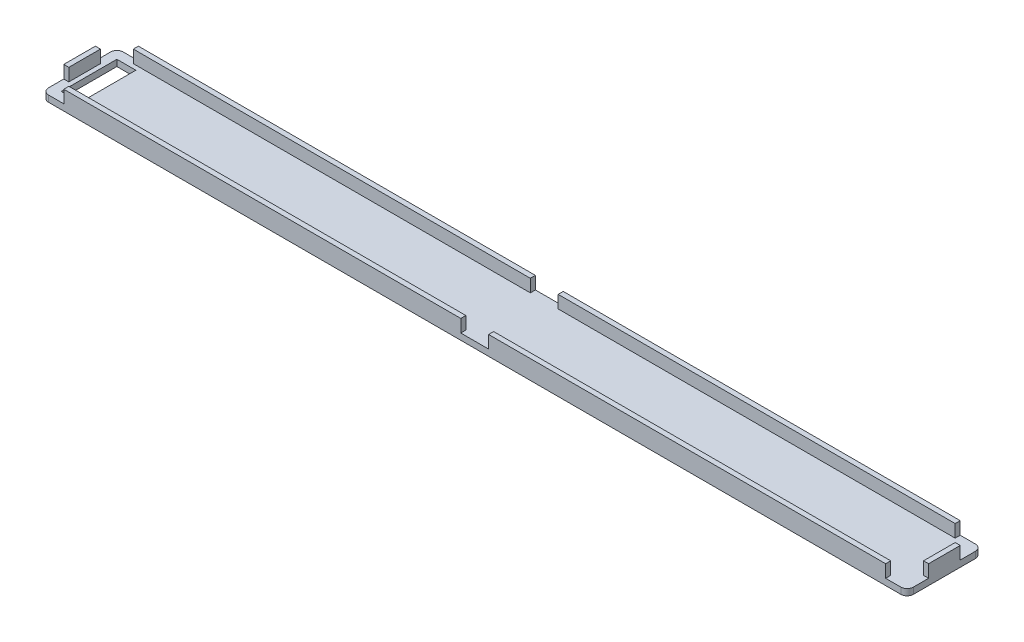
ISO-10303-21;
HEADER;
FILE_DESCRIPTION(('STEP AP214'),'2;1');
FILE_NAME('part.step','',(''),(''),'','','');
FILE_SCHEMA(('AUTOMOTIVE_DESIGN { 1 0 10303 214 1 1 1 1 }'));
ENDSEC;
DATA;
#1=APPLICATION_CONTEXT('core data for automotive mechanical design processes');
#2=APPLICATION_PROTOCOL_DEFINITION('international standard','automotive_design',2000,#1);
#3=PRODUCT_CONTEXT('',#1,'mechanical');
#4=PRODUCT('Part','Part','',(#3));
#5=PRODUCT_RELATED_PRODUCT_CATEGORY('part','',(#4));
#6=PRODUCT_DEFINITION_FORMATION('','',#4);
#7=PRODUCT_DEFINITION_CONTEXT('part definition',#1,'design');
#8=PRODUCT_DEFINITION('design','',#6,#7);
#9=PRODUCT_DEFINITION_SHAPE('','',#8);
#10=(LENGTH_UNIT() NAMED_UNIT(*) SI_UNIT(.MILLI.,.METRE.));
#11=(NAMED_UNIT(*) PLANE_ANGLE_UNIT() SI_UNIT($,.RADIAN.));
#12=(NAMED_UNIT(*) SI_UNIT($,.STERADIAN.) SOLID_ANGLE_UNIT());
#13=UNCERTAINTY_MEASURE_WITH_UNIT(LENGTH_MEASURE(1.E-05),#10,'distance_accuracy_value','');
#14=(GEOMETRIC_REPRESENTATION_CONTEXT(3) GLOBAL_UNCERTAINTY_ASSIGNED_CONTEXT((#13)) GLOBAL_UNIT_ASSIGNED_CONTEXT((#10,
#11,#12)) REPRESENTATION_CONTEXT('',''));
#15=CARTESIAN_POINT('',(0.,0.,0.));
#16=DIRECTION('',(0.,0.,1.));
#17=DIRECTION('',(1.,0.,0.));
#18=AXIS2_PLACEMENT_3D('',#15,#16,#17);
#19=CARTESIAN_POINT('',(0.,3.,0.));
#20=DIRECTION('',(0.,-1.,0.));
#21=DIRECTION('',(0.,0.,-1.));
#22=AXIS2_PLACEMENT_3D('',#19,#20,#21);
#23=PLANE('',#22);
#24=DIRECTION('',(1.,0.,0.));
#25=VECTOR('',#24,1.);
#26=CARTESIAN_POINT('',(136.8,3.,0.));
#27=LINE('',#26,#25);
#28=CARTESIAN_POINT('',(70.6,3.,0.));
#29=VERTEX_POINT('',#28);
#30=CARTESIAN_POINT('',(133.4,3.,0.));
#31=VERTEX_POINT('',#30);
#32=EDGE_CURVE('E485',#29,#31,#27,.T.);
#33=ORIENTED_EDGE('',*,*,#32,.T.);
#34=DIRECTION('',(0.,0.,1.));
#35=VECTOR('',#34,1.);
#36=CARTESIAN_POINT('',(133.4,3.,-0.799999999999993));
#37=LINE('',#36,#35);
#38=CARTESIAN_POINT('',(133.4,3.,-0.799999999999993));
#39=VERTEX_POINT('',#38);
#40=EDGE_CURVE('E307',#39,#31,#37,.T.);
#41=ORIENTED_EDGE('',*,*,#40,.F.);
#42=DIRECTION('',(1.,0.,0.));
#43=VECTOR('',#42,1.);
#44=CARTESIAN_POINT('',(136.,3.,-0.8));
#45=LINE('',#44,#43);
#46=CARTESIAN_POINT('',(70.6,3.,-0.799999999999985));
#47=VERTEX_POINT('',#46);
#48=EDGE_CURVE('E456',#47,#39,#45,.T.);
#49=ORIENTED_EDGE('',*,*,#48,.F.);
#50=DIRECTION('',(0.,0.,-1.));
#51=VECTOR('',#50,1.);
#52=CARTESIAN_POINT('',(70.6,3.,0.));
#53=LINE('',#52,#51);
#54=EDGE_CURVE('E390',#29,#47,#53,.T.);
#55=ORIENTED_EDGE('',*,*,#54,.F.);
#56=EDGE_LOOP('',(#33,#41,#49,#55));
#57=FACE_BOUND('',#56,.T.);
#58=ADVANCED_FACE('F39',(#57),#23,.F.);
#59=CARTESIAN_POINT('',(3.39999999999999,3.,0.));
#60=VERTEX_POINT('',#59);
#61=CARTESIAN_POINT('',(66.2,3.,0.));
#62=VERTEX_POINT('',#61);
#63=EDGE_CURVE('E488',#60,#62,#27,.T.);
#64=ORIENTED_EDGE('',*,*,#63,.T.);
#65=DIRECTION('',(0.,0.,1.));
#66=VECTOR('',#65,1.);
#67=CARTESIAN_POINT('',(66.2,3.,0.));
#68=LINE('',#67,#66);
#69=CARTESIAN_POINT('',(66.2,3.,-0.799999999999983));
#70=VERTEX_POINT('',#69);
#71=EDGE_CURVE('E384',#70,#62,#68,.T.);
#72=ORIENTED_EDGE('',*,*,#71,.F.);
#73=CARTESIAN_POINT('',(3.39999999999999,3.,-0.799999999999977));
#74=VERTEX_POINT('',#73);
#75=EDGE_CURVE('E459',#74,#70,#45,.T.);
#76=ORIENTED_EDGE('',*,*,#75,.F.);
#77=DIRECTION('',(0.,0.,-1.));
#78=VECTOR('',#77,1.);
#79=CARTESIAN_POINT('',(3.39999999999999,3.,-0.799999999999977));
#80=LINE('',#79,#78);
#81=EDGE_CURVE('E368',#60,#74,#80,.T.);
#82=ORIENTED_EDGE('',*,*,#81,.F.);
#83=EDGE_LOOP('',(#64,#72,#76,#82));
#84=FACE_BOUND('',#83,.T.);
#85=ADVANCED_FACE('F586',(#84),#23,.F.);
#86=DIRECTION('',(0.,0.,1.));
#87=VECTOR('',#86,1.);
#88=CARTESIAN_POINT('',(0.,3.,-11.8));
#89=LINE('',#88,#87);
#90=CARTESIAN_POINT('',(0.,3.,-8.39999999999998));
#91=VERTEX_POINT('',#90);
#92=CARTESIAN_POINT('',(0.,3.,-3.39999999999998));
#93=VERTEX_POINT('',#92);
#94=EDGE_CURVE('E482',#91,#93,#89,.T.);
#95=ORIENTED_EDGE('',*,*,#94,.T.);
#96=DIRECTION('',(-1.,0.,0.));
#97=VECTOR('',#96,1.);
#98=CARTESIAN_POINT('',(0.,3.,-3.39999999999998));
#99=LINE('',#98,#97);
#100=CARTESIAN_POINT('',(0.799999999999996,3.,-3.39999999999998));
#101=VERTEX_POINT('',#100);
#102=EDGE_CURVE('E360',#101,#93,#99,.T.);
#103=ORIENTED_EDGE('',*,*,#102,.F.);
#104=DIRECTION('',(0.,0.,1.));
#105=VECTOR('',#104,1.);
#106=CARTESIAN_POINT('',(0.799999999999995,3.,-11.));
#107=LINE('',#106,#105);
#108=CARTESIAN_POINT('',(0.799999999999995,3.,-8.39999999999998));
#109=VERTEX_POINT('',#108);
#110=EDGE_CURVE('E453',#109,#101,#107,.T.);
#111=ORIENTED_EDGE('',*,*,#110,.F.);
#112=DIRECTION('',(1.,0.,0.));
#113=VECTOR('',#112,1.);
#114=CARTESIAN_POINT('',(0.,3.,-8.39999999999998));
#115=LINE('',#114,#113);
#116=EDGE_CURVE('E338',#91,#109,#115,.T.);
#117=ORIENTED_EDGE('',*,*,#116,.F.);
#118=EDGE_LOOP('',(#95,#103,#111,#117));
#119=FACE_BOUND('',#118,.T.);
#120=ADVANCED_FACE('F570',(#119),#23,.F.);
#121=DIRECTION('',(-1.,0.,0.));
#122=VECTOR('',#121,1.);
#123=CARTESIAN_POINT('',(136.8,3.,-11.8));
#124=LINE('',#123,#122);
#125=CARTESIAN_POINT('',(66.2,3.,-11.8));
#126=VERTEX_POINT('',#125);
#127=CARTESIAN_POINT('',(3.39999999999999,3.,-11.8));
#128=VERTEX_POINT('',#127);
#129=EDGE_CURVE('E478',#126,#128,#124,.T.);
#130=ORIENTED_EDGE('',*,*,#129,.T.);
#131=DIRECTION('',(0.,0.,-1.));
#132=VECTOR('',#131,1.);
#133=CARTESIAN_POINT('',(3.39999999999999,3.,-11.));
#134=LINE('',#133,#132);
#135=CARTESIAN_POINT('',(3.39999999999999,3.,-11.));
#136=VERTEX_POINT('',#135);
#137=EDGE_CURVE('E345',#136,#128,#134,.T.);
#138=ORIENTED_EDGE('',*,*,#137,.F.);
#139=DIRECTION('',(-1.,0.,0.));
#140=VECTOR('',#139,1.);
#141=CARTESIAN_POINT('',(136.,3.,-11.));
#142=LINE('',#141,#140);
#143=CARTESIAN_POINT('',(66.2,3.,-11.));
#144=VERTEX_POINT('',#143);
#145=EDGE_CURVE('E448',#144,#136,#142,.T.);
#146=ORIENTED_EDGE('',*,*,#145,.F.);
#147=DIRECTION('',(0.,0.,1.));
#148=VECTOR('',#147,1.);
#149=CARTESIAN_POINT('',(66.2,3.,-11.8));
#150=LINE('',#149,#148);
#151=EDGE_CURVE('E314',#126,#144,#150,.T.);
#152=ORIENTED_EDGE('',*,*,#151,.F.);
#153=EDGE_LOOP('',(#130,#138,#146,#152));
#154=FACE_BOUND('',#153,.T.);
#155=ADVANCED_FACE('F610',(#154),#23,.F.);
#156=CARTESIAN_POINT('',(133.4,3.,-11.8));
#157=VERTEX_POINT('',#156);
#158=CARTESIAN_POINT('',(70.6,3.,-11.8));
#159=VERTEX_POINT('',#158);
#160=EDGE_CURVE('E481',#157,#159,#124,.T.);
#161=ORIENTED_EDGE('',*,*,#160,.T.);
#162=DIRECTION('',(0.,0.,-1.));
#163=VECTOR('',#162,1.);
#164=CARTESIAN_POINT('',(70.6,3.,-11.8));
#165=LINE('',#164,#163);
#166=CARTESIAN_POINT('',(70.6,3.,-11.));
#167=VERTEX_POINT('',#166);
#168=EDGE_CURVE('E320',#167,#159,#165,.T.);
#169=ORIENTED_EDGE('',*,*,#168,.F.);
#170=CARTESIAN_POINT('',(133.4,3.,-11.));
#171=VERTEX_POINT('',#170);
#172=EDGE_CURVE('E451',#171,#167,#142,.T.);
#173=ORIENTED_EDGE('',*,*,#172,.F.);
#174=DIRECTION('',(0.,0.,1.));
#175=VECTOR('',#174,1.);
#176=CARTESIAN_POINT('',(133.4,3.,-11.));
#177=LINE('',#176,#175);
#178=EDGE_CURVE('E326',#157,#171,#177,.T.);
#179=ORIENTED_EDGE('',*,*,#178,.F.);
#180=EDGE_LOOP('',(#161,#169,#173,#179));
#181=FACE_BOUND('',#180,.T.);
#182=ADVANCED_FACE('F599',(#181),#23,.F.);
#183=CARTESIAN_POINT('',(136.,3.,-11.));
#184=DIRECTION('',(0.,0.,1.));
#185=DIRECTION('',(1.,0.,0.));
#186=AXIS2_PLACEMENT_3D('',#183,#184,#185);
#187=PLANE('',#186);
#188=DIRECTION('',(0.,1.,0.));
#189=VECTOR('',#188,1.);
#190=CARTESIAN_POINT('',(70.6,1.,-11.));
#191=LINE('',#190,#189);
#192=CARTESIAN_POINT('',(70.6,1.,-11.));
#193=VERTEX_POINT('',#192);
#194=EDGE_CURVE('E324',#193,#167,#191,.T.);
#195=ORIENTED_EDGE('',*,*,#194,.F.);
#196=DIRECTION('',(-1.,0.,0.));
#197=VECTOR('',#196,1.);
#198=CARTESIAN_POINT('',(136.,1.,-11.));
#199=LINE('',#198,#197);
#200=CARTESIAN_POINT('',(133.4,1.,-11.));
#201=VERTEX_POINT('',#200);
#202=EDGE_CURVE('E466',#201,#193,#199,.T.);
#203=ORIENTED_EDGE('',*,*,#202,.F.);
#204=DIRECTION('',(0.,1.,0.));
#205=VECTOR('',#204,1.);
#206=CARTESIAN_POINT('',(133.4,1.,-11.));
#207=LINE('',#206,#205);
#208=EDGE_CURVE('E444',#201,#171,#207,.T.);
#209=ORIENTED_EDGE('',*,*,#208,.T.);
#210=ORIENTED_EDGE('',*,*,#172,.T.);
#211=EDGE_LOOP('',(#195,#203,#209,#210));
#212=FACE_BOUND('',#211,.T.);
#213=ADVANCED_FACE('F605',(#212),#187,.T.);
#214=CARTESIAN_POINT('',(136.,3.,-0.8));
#215=DIRECTION('',(0.,0.,-1.));
#216=DIRECTION('',(-1.,0.,0.));
#217=AXIS2_PLACEMENT_3D('',#214,#215,#216);
#218=PLANE('',#217);
#219=DIRECTION('',(0.,1.,0.));
#220=VECTOR('',#219,1.);
#221=CARTESIAN_POINT('',(66.2,1.,-0.799999999999983));
#222=LINE('',#221,#220);
#223=CARTESIAN_POINT('',(66.2,1.,-0.799999999999983));
#224=VERTEX_POINT('',#223);
#225=EDGE_CURVE('E396',#224,#70,#222,.T.);
#226=ORIENTED_EDGE('',*,*,#225,.F.);
#227=DIRECTION('',(1.,0.,0.));
#228=VECTOR('',#227,1.);
#229=CARTESIAN_POINT('',(136.,1.,-0.8));
#230=LINE('',#229,#228);
#231=CARTESIAN_POINT('',(3.39999999999999,1.,-0.799999999999983));
#232=VERTEX_POINT('',#231);
#233=EDGE_CURVE('E473',#232,#224,#230,.T.);
#234=ORIENTED_EDGE('',*,*,#233,.F.);
#235=DIRECTION('',(0.,1.,0.));
#236=VECTOR('',#235,1.);
#237=CARTESIAN_POINT('',(3.39999999999999,1.,-0.799999999999977));
#238=LINE('',#237,#236);
#239=EDGE_CURVE('E376',#232,#74,#238,.T.);
#240=ORIENTED_EDGE('',*,*,#239,.T.);
#241=ORIENTED_EDGE('',*,*,#75,.T.);
#242=EDGE_LOOP('',(#226,#234,#240,#241));
#243=FACE_BOUND('',#242,.T.);
#244=ADVANCED_FACE('F616',(#243),#218,.T.);
#245=CARTESIAN_POINT('',(0.,1.,0.));
#246=DIRECTION('',(1.,0.,0.));
#247=DIRECTION('',(0.,0.,-1.));
#248=AXIS2_PLACEMENT_3D('',#245,#246,#247);
#249=PLANE('',#248);
#250=DIRECTION('',(0.,0.,1.));
#251=VECTOR('',#250,1.);
#252=CARTESIAN_POINT('',(0.,1.,-11.8));
#253=LINE('',#252,#251);
#254=CARTESIAN_POINT('',(0.,1.,-10.8));
#255=VERTEX_POINT('',#254);
#256=CARTESIAN_POINT('',(0.,1.,-8.39999999999998));
#257=VERTEX_POINT('',#256);
#258=EDGE_CURVE('E340',#255,#257,#253,.T.);
#259=ORIENTED_EDGE('',*,*,#258,.F.);
#260=DIRECTION('',(0.,-1.,0.));
#261=VECTOR('',#260,1.);
#262=CARTESIAN_POINT('',(0.,1.,-10.8));
#263=LINE('',#262,#261);
#264=CARTESIAN_POINT('',(0.,0.,-10.8));
#265=VERTEX_POINT('',#264);
#266=EDGE_CURVE('E11',#255,#265,#263,.T.);
#267=ORIENTED_EDGE('',*,*,#266,.T.);
#268=DIRECTION('',(0.,0.,1.));
#269=VECTOR('',#268,1.);
#270=CARTESIAN_POINT('',(0.,0.,0.));
#271=LINE('',#270,#269);
#272=CARTESIAN_POINT('',(0.,0.,-1.));
#273=VERTEX_POINT('',#272);
#274=EDGE_CURVE('E489',#265,#273,#271,.T.);
#275=ORIENTED_EDGE('',*,*,#274,.T.);
#276=DIRECTION('',(0.,-1.,0.));
#277=VECTOR('',#276,1.);
#278=CARTESIAN_POINT('',(0.,1.,-1.));
#279=LINE('',#278,#277);
#280=CARTESIAN_POINT('',(0.,1.,-1.));
#281=VERTEX_POINT('',#280);
#282=EDGE_CURVE('E47',#273,#281,#279,.F.);
#283=ORIENTED_EDGE('',*,*,#282,.T.);
#284=DIRECTION('',(0.,0.,1.));
#285=VECTOR('',#284,1.);
#286=CARTESIAN_POINT('',(0.,1.,0.));
#287=LINE('',#286,#285);
#288=CARTESIAN_POINT('',(0.,1.,-3.39999999999998));
#289=VERTEX_POINT('',#288);
#290=EDGE_CURVE('E365',#289,#281,#287,.T.);
#291=ORIENTED_EDGE('',*,*,#290,.F.);
#292=DIRECTION('',(0.,1.,0.));
#293=VECTOR('',#292,1.);
#294=CARTESIAN_POINT('',(0.,1.,-3.39999999999998));
#295=LINE('',#294,#293);
#296=EDGE_CURVE('E347',#289,#93,#295,.T.);
#297=ORIENTED_EDGE('',*,*,#296,.T.);
#298=ORIENTED_EDGE('',*,*,#94,.F.);
#299=DIRECTION('',(0.,1.,0.));
#300=VECTOR('',#299,1.);
#301=CARTESIAN_POINT('',(0.,1.,-8.39999999999998));
#302=LINE('',#301,#300);
#303=EDGE_CURVE('E353',#257,#91,#302,.T.);
#304=ORIENTED_EDGE('',*,*,#303,.F.);
#305=EDGE_LOOP('',(#259,#267,#275,#283,#291,#297,#298,#304));
#306=FACE_BOUND('',#305,.T.);
#307=ADVANCED_FACE('F552',(#306),#249,.F.);
#308=CARTESIAN_POINT('',(0.,1.,0.));
#309=DIRECTION('',(0.,0.,-1.));
#310=DIRECTION('',(-1.,0.,0.));
#311=AXIS2_PLACEMENT_3D('',#308,#309,#310);
#312=PLANE('',#311);
#313=DIRECTION('',(1.,0.,0.));
#314=VECTOR('',#313,1.);
#315=CARTESIAN_POINT('',(0.,0.,0.));
#316=LINE('',#315,#314);
#317=CARTESIAN_POINT('',(1.,0.,0.));
#318=VERTEX_POINT('',#317);
#319=CARTESIAN_POINT('',(135.8,0.,0.));
#320=VERTEX_POINT('',#319);
#321=EDGE_CURVE('E491',#318,#320,#316,.T.);
#322=ORIENTED_EDGE('',*,*,#321,.T.);
#323=DIRECTION('',(0.,-1.,0.));
#324=VECTOR('',#323,1.);
#325=CARTESIAN_POINT('',(135.8,1.,0.));
#326=LINE('',#325,#324);
#327=CARTESIAN_POINT('',(135.8,1.,0.));
#328=VERTEX_POINT('',#327);
#329=EDGE_CURVE('E525',#320,#328,#326,.F.);
#330=ORIENTED_EDGE('',*,*,#329,.T.);
#331=DIRECTION('',(1.,0.,0.));
#332=VECTOR('',#331,1.);
#333=CARTESIAN_POINT('',(133.4,1.,0.));
#334=LINE('',#333,#332);
#335=CARTESIAN_POINT('',(133.4,1.,0.));
#336=VERTEX_POINT('',#335);
#337=EDGE_CURVE('E405',#336,#328,#334,.T.);
#338=ORIENTED_EDGE('',*,*,#337,.F.);
#339=DIRECTION('',(0.,1.,0.));
#340=VECTOR('',#339,1.);
#341=CARTESIAN_POINT('',(133.4,1.,0.));
#342=LINE('',#341,#340);
#343=EDGE_CURVE('E413',#336,#31,#342,.T.);
#344=ORIENTED_EDGE('',*,*,#343,.T.);
#345=ORIENTED_EDGE('',*,*,#32,.F.);
#346=DIRECTION('',(0.,1.,0.));
#347=VECTOR('',#346,1.);
#348=CARTESIAN_POINT('',(70.6,1.,0.));
#349=LINE('',#348,#347);
#350=CARTESIAN_POINT('',(70.6,1.,0.));
#351=VERTEX_POINT('',#350);
#352=EDGE_CURVE('E389',#351,#29,#349,.T.);
#353=ORIENTED_EDGE('',*,*,#352,.F.);
#354=DIRECTION('',(1.,0.,0.));
#355=VECTOR('',#354,1.);
#356=CARTESIAN_POINT('',(70.6,1.,0.));
#357=LINE('',#356,#355);
#358=CARTESIAN_POINT('',(66.2,1.,0.));
#359=VERTEX_POINT('',#358);
#360=EDGE_CURVE('E380',#359,#351,#357,.T.);
#361=ORIENTED_EDGE('',*,*,#360,.F.);
#362=DIRECTION('',(0.,1.,0.));
#363=VECTOR('',#362,1.);
#364=CARTESIAN_POINT('',(66.2,1.,0.));
#365=LINE('',#364,#363);
#366=EDGE_CURVE('E370',#359,#62,#365,.T.);
#367=ORIENTED_EDGE('',*,*,#366,.T.);
#368=ORIENTED_EDGE('',*,*,#63,.F.);
#369=DIRECTION('',(0.,1.,0.));
#370=VECTOR('',#369,1.);
#371=CARTESIAN_POINT('',(3.39999999999999,1.,0.));
#372=LINE('',#371,#370);
#373=CARTESIAN_POINT('',(3.39999999999999,1.,0.));
#374=VERTEX_POINT('',#373);
#375=EDGE_CURVE('E367',#374,#60,#372,.T.);
#376=ORIENTED_EDGE('',*,*,#375,.F.);
#377=DIRECTION('',(1.,0.,0.));
#378=VECTOR('',#377,1.);
#379=CARTESIAN_POINT('',(3.39999999999999,1.,0.));
#380=LINE('',#379,#378);
#381=CARTESIAN_POINT('',(1.,1.,0.));
#382=VERTEX_POINT('',#381);
#383=EDGE_CURVE('E357',#382,#374,#380,.T.);
#384=ORIENTED_EDGE('',*,*,#383,.F.);
#385=DIRECTION('',(0.,-1.,0.));
#386=VECTOR('',#385,1.);
#387=CARTESIAN_POINT('',(1.,1.,0.));
#388=LINE('',#387,#386);
#389=EDGE_CURVE('E522',#382,#318,#388,.T.);
#390=ORIENTED_EDGE('',*,*,#389,.T.);
#391=EDGE_LOOP('',(#322,#330,#338,#344,#345,#353,#361,#367,#368,#376,#384,#390));
#392=FACE_BOUND('',#391,.T.);
#393=ADVANCED_FACE('F801',(#392),#312,.F.);
#394=CARTESIAN_POINT('',(136.8,1.,0.));
#395=DIRECTION('',(-1.,0.,0.));
#396=DIRECTION('',(0.,0.,1.));
#397=AXIS2_PLACEMENT_3D('',#394,#395,#396);
#398=PLANE('',#397);
#399=DIRECTION('',(0.,0.,-1.));
#400=VECTOR('',#399,1.);
#401=CARTESIAN_POINT('',(136.8,1.,0.));
#402=LINE('',#401,#400);
#403=CARTESIAN_POINT('',(136.8,1.,-1.));
#404=VERTEX_POINT('',#403);
#405=CARTESIAN_POINT('',(136.8,1.,-3.4));
#406=VERTEX_POINT('',#405);
#407=EDGE_CURVE('E409',#404,#406,#402,.T.);
#408=ORIENTED_EDGE('',*,*,#407,.F.);
#409=DIRECTION('',(0.,-1.,0.));
#410=VECTOR('',#409,1.);
#411=CARTESIAN_POINT('',(136.8,1.,-1.));
#412=LINE('',#411,#410);
#413=CARTESIAN_POINT('',(136.8,0.,-1.));
#414=VERTEX_POINT('',#413);
#415=EDGE_CURVE('E511',#404,#414,#412,.T.);
#416=ORIENTED_EDGE('',*,*,#415,.T.);
#417=DIRECTION('',(0.,0.,-1.));
#418=VECTOR('',#417,1.);
#419=CARTESIAN_POINT('',(136.8,0.,0.));
#420=LINE('',#419,#418);
#421=CARTESIAN_POINT('',(136.8,0.,-10.8));
#422=VERTEX_POINT('',#421);
#423=EDGE_CURVE('E494',#414,#422,#420,.T.);
#424=ORIENTED_EDGE('',*,*,#423,.T.);
#425=DIRECTION('',(0.,-1.,0.));
#426=VECTOR('',#425,1.);
#427=CARTESIAN_POINT('',(136.8,1.,-10.8));
#428=LINE('',#427,#426);
#429=CARTESIAN_POINT('',(136.8,1.,-10.8));
#430=VERTEX_POINT('',#429);
#431=EDGE_CURVE('E509',#422,#430,#428,.F.);
#432=ORIENTED_EDGE('',*,*,#431,.T.);
#433=DIRECTION('',(0.,0.,-1.));
#434=VECTOR('',#433,1.);
#435=CARTESIAN_POINT('',(136.8,1.,-11.8));
#436=LINE('',#435,#434);
#437=CARTESIAN_POINT('',(136.8,1.,-8.4));
#438=VERTEX_POINT('',#437);
#439=EDGE_CURVE('E432',#438,#430,#436,.T.);
#440=ORIENTED_EDGE('',*,*,#439,.F.);
#441=DIRECTION('',(0.,1.,0.));
#442=VECTOR('',#441,1.);
#443=CARTESIAN_POINT('',(136.8,1.,-8.4));
#444=LINE('',#443,#442);
#445=CARTESIAN_POINT('',(136.8,3.,-8.4));
#446=VERTEX_POINT('',#445);
#447=EDGE_CURVE('E438',#438,#446,#444,.T.);
#448=ORIENTED_EDGE('',*,*,#447,.T.);
#449=DIRECTION('',(0.,0.,-1.));
#450=VECTOR('',#449,1.);
#451=CARTESIAN_POINT('',(136.8,3.,-11.8));
#452=LINE('',#451,#450);
#453=CARTESIAN_POINT('',(136.8,3.,-3.4));
#454=VERTEX_POINT('',#453);
#455=EDGE_CURVE('E463',#454,#446,#452,.T.);
#456=ORIENTED_EDGE('',*,*,#455,.F.);
#457=DIRECTION('',(0.,1.,0.));
#458=VECTOR('',#457,1.);
#459=CARTESIAN_POINT('',(136.8,1.,-3.4));
#460=LINE('',#459,#458);
#461=EDGE_CURVE('E420',#406,#454,#460,.T.);
#462=ORIENTED_EDGE('',*,*,#461,.F.);
#463=EDGE_LOOP('',(#408,#416,#424,#432,#440,#448,#456,#462));
#464=FACE_BOUND('',#463,.T.);
#465=ADVANCED_FACE('F831',(#464),#398,.F.);
#466=CARTESIAN_POINT('',(0.,1.,-11.8));
#467=DIRECTION('',(0.,0.,1.));
#468=DIRECTION('',(1.,0.,0.));
#469=AXIS2_PLACEMENT_3D('',#466,#467,#468);
#470=PLANE('',#469);
#471=DIRECTION('',(-1.,0.,0.));
#472=VECTOR('',#471,1.);
#473=CARTESIAN_POINT('',(133.4,1.,-11.8));
#474=LINE('',#473,#472);
#475=CARTESIAN_POINT('',(135.8,1.,-11.8));
#476=VERTEX_POINT('',#475);
#477=CARTESIAN_POINT('',(133.4,1.,-11.8));
#478=VERTEX_POINT('',#477);
#479=EDGE_CURVE('E424',#476,#478,#474,.T.);
#480=ORIENTED_EDGE('',*,*,#479,.F.);
#481=DIRECTION('',(0.,-1.,0.));
#482=VECTOR('',#481,1.);
#483=CARTESIAN_POINT('',(135.8,1.,-11.8));
#484=LINE('',#483,#482);
#485=CARTESIAN_POINT('',(135.8,0.,-11.8));
#486=VERTEX_POINT('',#485);
#487=EDGE_CURVE('E536',#476,#486,#484,.T.);
#488=ORIENTED_EDGE('',*,*,#487,.T.);
#489=DIRECTION('',(-1.,0.,0.));
#490=VECTOR('',#489,1.);
#491=CARTESIAN_POINT('',(0.,0.,-11.8));
#492=LINE('',#491,#490);
#493=CARTESIAN_POINT('',(1.,0.,-11.8));
#494=VERTEX_POINT('',#493);
#495=EDGE_CURVE('E497',#486,#494,#492,.T.);
#496=ORIENTED_EDGE('',*,*,#495,.T.);
#497=DIRECTION('',(0.,-1.,0.));
#498=VECTOR('',#497,1.);
#499=CARTESIAN_POINT('',(1.,1.,-11.8));
#500=LINE('',#499,#498);
#501=CARTESIAN_POINT('',(1.,1.,-11.8));
#502=VERTEX_POINT('',#501);
#503=EDGE_CURVE('E534',#494,#502,#500,.F.);
#504=ORIENTED_EDGE('',*,*,#503,.T.);
#505=DIRECTION('',(-1.,0.,0.));
#506=VECTOR('',#505,1.);
#507=CARTESIAN_POINT('',(3.39999999999999,1.,-11.8));
#508=LINE('',#507,#506);
#509=CARTESIAN_POINT('',(3.39999999999999,1.,-11.8));
#510=VERTEX_POINT('',#509);
#511=EDGE_CURVE('E337',#510,#502,#508,.T.);
#512=ORIENTED_EDGE('',*,*,#511,.F.);
#513=DIRECTION('',(0.,1.,0.));
#514=VECTOR('',#513,1.);
#515=CARTESIAN_POINT('',(3.39999999999999,1.,-11.8));
#516=LINE('',#515,#514);
#517=EDGE_CURVE('E344',#510,#128,#516,.T.);
#518=ORIENTED_EDGE('',*,*,#517,.T.);
#519=ORIENTED_EDGE('',*,*,#129,.F.);
#520=DIRECTION('',(0.,1.,0.));
#521=VECTOR('',#520,1.);
#522=CARTESIAN_POINT('',(66.2,1.,-11.8));
#523=LINE('',#522,#521);
#524=CARTESIAN_POINT('',(66.2,1.,-11.8));
#525=VERTEX_POINT('',#524);
#526=EDGE_CURVE('E330',#525,#126,#523,.T.);
#527=ORIENTED_EDGE('',*,*,#526,.F.);
#528=DIRECTION('',(-1.,0.,0.));
#529=VECTOR('',#528,1.);
#530=CARTESIAN_POINT('',(70.6,1.,-11.8));
#531=LINE('',#530,#529);
#532=CARTESIAN_POINT('',(70.6,1.,-11.8));
#533=VERTEX_POINT('',#532);
#534=EDGE_CURVE('E313',#533,#525,#531,.T.);
#535=ORIENTED_EDGE('',*,*,#534,.F.);
#536=DIRECTION('',(0.,1.,0.));
#537=VECTOR('',#536,1.);
#538=CARTESIAN_POINT('',(70.6,1.,-11.8));
#539=LINE('',#538,#537);
#540=EDGE_CURVE('E319',#533,#159,#539,.T.);
#541=ORIENTED_EDGE('',*,*,#540,.T.);
#542=ORIENTED_EDGE('',*,*,#160,.F.);
#543=DIRECTION('',(0.,1.,0.));
#544=VECTOR('',#543,1.);
#545=CARTESIAN_POINT('',(133.4,1.,-11.8));
#546=LINE('',#545,#544);
#547=EDGE_CURVE('E435',#478,#157,#546,.T.);
#548=ORIENTED_EDGE('',*,*,#547,.F.);
#549=EDGE_LOOP('',(#480,#488,#496,#504,#512,#518,#519,#527,#535,#541,#542,#548));
#550=FACE_BOUND('',#549,.T.);
#551=ADVANCED_FACE('F542',(#550),#470,.F.);
#552=CARTESIAN_POINT('',(0.,0.,0.));
#553=DIRECTION('',(0.,-1.,0.));
#554=DIRECTION('',(0.,0.,-1.));
#555=AXIS2_PLACEMENT_3D('',#552,#553,#554);
#556=PLANE('',#555);
#557=DIRECTION('',(0.,0.,1.));
#558=VECTOR('',#557,1.);
#559=CARTESIAN_POINT('',(4.5,0.,-1.5));
#560=LINE('',#559,#558);
#561=CARTESIAN_POINT('',(4.5,0.,-10.3));
#562=VERTEX_POINT('',#561);
#563=CARTESIAN_POINT('',(4.5,0.,-1.5));
#564=VERTEX_POINT('',#563);
#565=EDGE_CURVE('E295',#562,#564,#560,.T.);
#566=ORIENTED_EDGE('',*,*,#565,.F.);
#567=DIRECTION('',(1.,0.,0.));
#568=VECTOR('',#567,1.);
#569=CARTESIAN_POINT('',(4.5,0.,-10.3));
#570=LINE('',#569,#568);
#571=CARTESIAN_POINT('',(1.5,0.,-10.3));
#572=VERTEX_POINT('',#571);
#573=EDGE_CURVE('E300',#572,#562,#570,.T.);
#574=ORIENTED_EDGE('',*,*,#573,.F.);
#575=DIRECTION('',(0.,0.,-1.));
#576=VECTOR('',#575,1.);
#577=CARTESIAN_POINT('',(1.5,0.,-1.5));
#578=LINE('',#577,#576);
#579=CARTESIAN_POINT('',(1.5,0.,-1.5));
#580=VERTEX_POINT('',#579);
#581=EDGE_CURVE('E279',#580,#572,#578,.T.);
#582=ORIENTED_EDGE('',*,*,#581,.F.);
#583=DIRECTION('',(-1.,0.,0.));
#584=VECTOR('',#583,1.);
#585=CARTESIAN_POINT('',(4.5,0.,-1.5));
#586=LINE('',#585,#584);
#587=EDGE_CURVE('E290',#564,#580,#586,.T.);
#588=ORIENTED_EDGE('',*,*,#587,.F.);
#589=EDGE_LOOP('',(#566,#574,#582,#588));
#590=FACE_BOUND('',#589,.T.);
#591=ORIENTED_EDGE('',*,*,#423,.F.);
#592=CARTESIAN_POINT('',(135.8,0.,-1.));
#593=DIRECTION('',(0.,-1.,0.));
#594=DIRECTION('',(0.,0.,-1.));
#595=AXIS2_PLACEMENT_3D('',#592,#593,#594);
#596=CIRCLE('',#595,1.);
#597=EDGE_CURVE('E520',#414,#320,#596,.T.);
#598=ORIENTED_EDGE('',*,*,#597,.T.);
#599=ORIENTED_EDGE('',*,*,#321,.F.);
#600=CARTESIAN_POINT('',(1.,0.,-1.));
#601=DIRECTION('',(0.,-1.,0.));
#602=DIRECTION('',(0.,0.,-1.));
#603=AXIS2_PLACEMENT_3D('',#600,#601,#602);
#604=CIRCLE('',#603,1.);
#605=EDGE_CURVE('E514',#318,#273,#604,.T.);
#606=ORIENTED_EDGE('',*,*,#605,.T.);
#607=ORIENTED_EDGE('',*,*,#274,.F.);
#608=CARTESIAN_POINT('',(1.,0.,-10.8));
#609=DIRECTION('',(0.,-1.,0.));
#610=DIRECTION('',(0.,0.,-1.));
#611=AXIS2_PLACEMENT_3D('',#608,#609,#610);
#612=CIRCLE('',#611,1.);
#613=EDGE_CURVE('E516',#265,#494,#612,.T.);
#614=ORIENTED_EDGE('',*,*,#613,.T.);
#615=ORIENTED_EDGE('',*,*,#495,.F.);
#616=CARTESIAN_POINT('',(135.8,0.,-10.8));
#617=DIRECTION('',(0.,-1.,0.));
#618=DIRECTION('',(0.,0.,-1.));
#619=AXIS2_PLACEMENT_3D('',#616,#617,#618);
#620=CIRCLE('',#619,1.);
#621=EDGE_CURVE('E518',#486,#422,#620,.T.);
#622=ORIENTED_EDGE('',*,*,#621,.T.);
#623=EDGE_LOOP('',(#591,#598,#599,#606,#607,#614,#615,#622));
#624=FACE_BOUND('',#623,.T.);
#625=ADVANCED_FACE('F297',(#590,#624),#556,.T.);
#626=DIRECTION('',(0.,0.,-1.));
#627=VECTOR('',#626,1.);
#628=CARTESIAN_POINT('',(136.,3.,-11.));
#629=LINE('',#628,#627);
#630=CARTESIAN_POINT('',(136.,3.,-3.4));
#631=VERTEX_POINT('',#630);
#632=CARTESIAN_POINT('',(136.,3.,-8.4));
#633=VERTEX_POINT('',#632);
#634=EDGE_CURVE('E460',#631,#633,#629,.T.);
#635=ORIENTED_EDGE('',*,*,#634,.F.);
#636=DIRECTION('',(-1.,0.,0.));
#637=VECTOR('',#636,1.);
#638=CARTESIAN_POINT('',(136.8,3.,-3.4));
#639=LINE('',#638,#637);
#640=EDGE_CURVE('E406',#454,#631,#639,.T.);
#641=ORIENTED_EDGE('',*,*,#640,.F.);
#642=ORIENTED_EDGE('',*,*,#455,.T.);
#643=DIRECTION('',(1.,0.,0.));
#644=VECTOR('',#643,1.);
#645=CARTESIAN_POINT('',(136.8,3.,-8.4));
#646=LINE('',#645,#644);
#647=EDGE_CURVE('E427',#633,#446,#646,.T.);
#648=ORIENTED_EDGE('',*,*,#647,.F.);
#649=EDGE_LOOP('',(#635,#641,#642,#648));
#650=FACE_BOUND('',#649,.T.);
#651=ADVANCED_FACE('F589',(#650),#23,.F.);
#652=DIRECTION('',(0.,1.,0.));
#653=VECTOR('',#652,1.);
#654=CARTESIAN_POINT('',(3.39999999999999,1.,-11.));
#655=LINE('',#654,#653);
#656=CARTESIAN_POINT('',(3.39999999999999,1.,-11.));
#657=VERTEX_POINT('',#656);
#658=EDGE_CURVE('E322',#657,#136,#655,.T.);
#659=ORIENTED_EDGE('',*,*,#658,.F.);
#660=CARTESIAN_POINT('',(66.2,1.,-11.));
#661=VERTEX_POINT('',#660);
#662=EDGE_CURVE('E441',#661,#657,#199,.T.);
#663=ORIENTED_EDGE('',*,*,#662,.F.);
#664=DIRECTION('',(0.,1.,0.));
#665=VECTOR('',#664,1.);
#666=CARTESIAN_POINT('',(66.2,1.,-11.));
#667=LINE('',#666,#665);
#668=EDGE_CURVE('E327',#661,#144,#667,.T.);
#669=ORIENTED_EDGE('',*,*,#668,.T.);
#670=ORIENTED_EDGE('',*,*,#145,.T.);
#671=EDGE_LOOP('',(#659,#663,#669,#670));
#672=FACE_BOUND('',#671,.T.);
#673=ADVANCED_FACE('F597',(#672),#187,.T.);
#674=CARTESIAN_POINT('',(0.799999999999995,3.,-11.));
#675=DIRECTION('',(1.,0.,0.));
#676=DIRECTION('',(0.,0.,-1.));
#677=AXIS2_PLACEMENT_3D('',#674,#675,#676);
#678=PLANE('',#677);
#679=DIRECTION('',(0.,1.,0.));
#680=VECTOR('',#679,1.);
#681=CARTESIAN_POINT('',(0.799999999999996,1.,-3.39999999999998));
#682=LINE('',#681,#680);
#683=CARTESIAN_POINT('',(0.799999999999996,1.,-3.39999999999998));
#684=VERTEX_POINT('',#683);
#685=EDGE_CURVE('E374',#684,#101,#682,.T.);
#686=ORIENTED_EDGE('',*,*,#685,.F.);
#687=DIRECTION('',(0.,0.,1.));
#688=VECTOR('',#687,1.);
#689=CARTESIAN_POINT('',(0.799999999999995,1.,-11.));
#690=LINE('',#689,#688);
#691=CARTESIAN_POINT('',(0.799999999999997,1.,-8.39999999999998));
#692=VERTEX_POINT('',#691);
#693=EDGE_CURVE('E467',#692,#684,#690,.T.);
#694=ORIENTED_EDGE('',*,*,#693,.F.);
#695=DIRECTION('',(0.,1.,0.));
#696=VECTOR('',#695,1.);
#697=CARTESIAN_POINT('',(0.799999999999995,1.,-8.39999999999998));
#698=LINE('',#697,#696);
#699=EDGE_CURVE('E350',#692,#109,#698,.T.);
#700=ORIENTED_EDGE('',*,*,#699,.T.);
#701=ORIENTED_EDGE('',*,*,#110,.T.);
#702=EDGE_LOOP('',(#686,#694,#700,#701));
#703=FACE_BOUND('',#702,.T.);
#704=ADVANCED_FACE('F565',(#703),#678,.T.);
#705=DIRECTION('',(0.,1.,0.));
#706=VECTOR('',#705,1.);
#707=CARTESIAN_POINT('',(133.4,1.,-0.799999999999993));
#708=LINE('',#707,#706);
#709=CARTESIAN_POINT('',(133.4,1.,-0.799999999999993));
#710=VERTEX_POINT('',#709);
#711=EDGE_CURVE('E392',#710,#39,#708,.T.);
#712=ORIENTED_EDGE('',*,*,#711,.F.);
#713=CARTESIAN_POINT('',(70.6,1.,-0.799999999999992));
#714=VERTEX_POINT('',#713);
#715=EDGE_CURVE('E470',#714,#710,#230,.T.);
#716=ORIENTED_EDGE('',*,*,#715,.F.);
#717=DIRECTION('',(0.,1.,0.));
#718=VECTOR('',#717,1.);
#719=CARTESIAN_POINT('',(70.6,1.,-0.799999999999985));
#720=LINE('',#719,#718);
#721=EDGE_CURVE('E398',#714,#47,#720,.T.);
#722=ORIENTED_EDGE('',*,*,#721,.T.);
#723=ORIENTED_EDGE('',*,*,#48,.T.);
#724=EDGE_LOOP('',(#712,#716,#722,#723));
#725=FACE_BOUND('',#724,.T.);
#726=ADVANCED_FACE('F652',(#725),#218,.T.);
#727=CARTESIAN_POINT('',(136.,3.,-11.));
#728=DIRECTION('',(-1.,0.,0.));
#729=DIRECTION('',(0.,0.,1.));
#730=AXIS2_PLACEMENT_3D('',#727,#728,#729);
#731=PLANE('',#730);
#732=DIRECTION('',(0.,1.,0.));
#733=VECTOR('',#732,1.);
#734=CARTESIAN_POINT('',(136.,1.,-3.4));
#735=LINE('',#734,#733);
#736=CARTESIAN_POINT('',(136.,1.,-3.4));
#737=VERTEX_POINT('',#736);
#738=EDGE_CURVE('E417',#737,#631,#735,.T.);
#739=ORIENTED_EDGE('',*,*,#738,.T.);
#740=ORIENTED_EDGE('',*,*,#634,.T.);
#741=DIRECTION('',(0.,1.,0.));
#742=VECTOR('',#741,1.);
#743=CARTESIAN_POINT('',(136.,1.,-8.4));
#744=LINE('',#743,#742);
#745=CARTESIAN_POINT('',(136.,1.,-8.4));
#746=VERTEX_POINT('',#745);
#747=EDGE_CURVE('E442',#746,#633,#744,.T.);
#748=ORIENTED_EDGE('',*,*,#747,.F.);
#749=DIRECTION('',(0.,0.,-1.));
#750=VECTOR('',#749,1.);
#751=CARTESIAN_POINT('',(136.,1.,-11.));
#752=LINE('',#751,#750);
#753=EDGE_CURVE('E452',#737,#746,#752,.T.);
#754=ORIENTED_EDGE('',*,*,#753,.F.);
#755=EDGE_LOOP('',(#739,#740,#748,#754));
#756=FACE_BOUND('',#755,.T.);
#757=ADVANCED_FACE('F649',(#756),#731,.T.);
#758=CARTESIAN_POINT('',(0.,1.,0.));
#759=DIRECTION('',(0.,-1.,0.));
#760=DIRECTION('',(0.,0.,-1.));
#761=AXIS2_PLACEMENT_3D('',#758,#759,#760);
#762=PLANE('',#761);
#763=DIRECTION('',(1.,0.,0.));
#764=VECTOR('',#763,1.);
#765=CARTESIAN_POINT('',(0.,1.,-10.3));
#766=LINE('',#765,#764);
#767=CARTESIAN_POINT('',(1.5,1.,-10.3));
#768=VERTEX_POINT('',#767);
#769=CARTESIAN_POINT('',(4.5,1.,-10.3));
#770=VERTEX_POINT('',#769);
#771=EDGE_CURVE('E503',#768,#770,#766,.T.);
#772=ORIENTED_EDGE('',*,*,#771,.T.);
#773=DIRECTION('',(0.,0.,1.));
#774=VECTOR('',#773,1.);
#775=CARTESIAN_POINT('',(4.5,1.,0.));
#776=LINE('',#775,#774);
#777=CARTESIAN_POINT('',(4.5,1.,-1.5));
#778=VERTEX_POINT('',#777);
#779=EDGE_CURVE('E506',#770,#778,#776,.T.);
#780=ORIENTED_EDGE('',*,*,#779,.T.);
#781=DIRECTION('',(-1.,0.,0.));
#782=VECTOR('',#781,1.);
#783=CARTESIAN_POINT('',(0.,1.,-1.5));
#784=LINE('',#783,#782);
#785=CARTESIAN_POINT('',(1.5,1.,-1.5));
#786=VERTEX_POINT('',#785);
#787=EDGE_CURVE('E500',#778,#786,#784,.T.);
#788=ORIENTED_EDGE('',*,*,#787,.T.);
#789=DIRECTION('',(0.,0.,-1.));
#790=VECTOR('',#789,1.);
#791=CARTESIAN_POINT('',(1.5,1.,0.));
#792=LINE('',#791,#790);
#793=EDGE_CURVE('E282',#786,#768,#792,.T.);
#794=ORIENTED_EDGE('',*,*,#793,.T.);
#795=EDGE_LOOP('',(#772,#780,#788,#794));
#796=FACE_BOUND('',#795,.T.);
#797=ORIENTED_EDGE('',*,*,#337,.T.);
#798=CARTESIAN_POINT('',(135.8,1.,-1.));
#799=DIRECTION('',(0.,-1.,0.));
#800=DIRECTION('',(0.,0.,-1.));
#801=AXIS2_PLACEMENT_3D('',#798,#799,#800);
#802=CIRCLE('',#801,1.);
#803=EDGE_CURVE('E532',#328,#404,#802,.F.);
#804=ORIENTED_EDGE('',*,*,#803,.T.);
#805=ORIENTED_EDGE('',*,*,#407,.T.);
#806=DIRECTION('',(-1.,0.,0.));
#807=VECTOR('',#806,1.);
#808=CARTESIAN_POINT('',(136.8,1.,-3.4));
#809=LINE('',#808,#807);
#810=EDGE_CURVE('E411',#406,#737,#809,.T.);
#811=ORIENTED_EDGE('',*,*,#810,.T.);
#812=ORIENTED_EDGE('',*,*,#753,.T.);
#813=DIRECTION('',(1.,0.,0.));
#814=VECTOR('',#813,1.);
#815=CARTESIAN_POINT('',(136.8,1.,-8.4));
#816=LINE('',#815,#814);
#817=EDGE_CURVE('E429',#746,#438,#816,.T.);
#818=ORIENTED_EDGE('',*,*,#817,.T.);
#819=ORIENTED_EDGE('',*,*,#439,.T.);
#820=CARTESIAN_POINT('',(135.8,1.,-10.8));
#821=DIRECTION('',(0.,-1.,0.));
#822=DIRECTION('',(0.,0.,-1.));
#823=AXIS2_PLACEMENT_3D('',#820,#821,#822);
#824=CIRCLE('',#823,1.);
#825=EDGE_CURVE('E530',#430,#476,#824,.F.);
#826=ORIENTED_EDGE('',*,*,#825,.T.);
#827=ORIENTED_EDGE('',*,*,#479,.T.);
#828=DIRECTION('',(0.,0.,1.));
#829=VECTOR('',#828,1.);
#830=CARTESIAN_POINT('',(133.4,1.,-11.));
#831=LINE('',#830,#829);
#832=EDGE_CURVE('E426',#478,#201,#831,.T.);
#833=ORIENTED_EDGE('',*,*,#832,.T.);
#834=ORIENTED_EDGE('',*,*,#202,.T.);
#835=DIRECTION('',(0.,0.,-1.));
#836=VECTOR('',#835,1.);
#837=CARTESIAN_POINT('',(70.6,1.,-11.8));
#838=LINE('',#837,#836);
#839=EDGE_CURVE('E310',#193,#533,#838,.T.);
#840=ORIENTED_EDGE('',*,*,#839,.T.);
#841=ORIENTED_EDGE('',*,*,#534,.T.);
#842=DIRECTION('',(0.,0.,1.));
#843=VECTOR('',#842,1.);
#844=CARTESIAN_POINT('',(66.2,1.,-11.8));
#845=LINE('',#844,#843);
#846=EDGE_CURVE('E317',#525,#661,#845,.T.);
#847=ORIENTED_EDGE('',*,*,#846,.T.);
#848=ORIENTED_EDGE('',*,*,#662,.T.);
#849=DIRECTION('',(0.,0.,-1.));
#850=VECTOR('',#849,1.);
#851=CARTESIAN_POINT('',(3.39999999999999,1.,-11.));
#852=LINE('',#851,#850);
#853=EDGE_CURVE('E334',#657,#510,#852,.T.);
#854=ORIENTED_EDGE('',*,*,#853,.T.);
#855=ORIENTED_EDGE('',*,*,#511,.T.);
#856=CARTESIAN_POINT('',(1.,1.,-10.8));
#857=DIRECTION('',(0.,-1.,0.));
#858=DIRECTION('',(0.,0.,-1.));
#859=AXIS2_PLACEMENT_3D('',#856,#857,#858);
#860=CIRCLE('',#859,1.);
#861=EDGE_CURVE('E61',#502,#255,#860,.F.);
#862=ORIENTED_EDGE('',*,*,#861,.T.);
#863=ORIENTED_EDGE('',*,*,#258,.T.);
#864=DIRECTION('',(1.,0.,0.));
#865=VECTOR('',#864,1.);
#866=CARTESIAN_POINT('',(0.,1.,-8.39999999999998));
#867=LINE('',#866,#865);
#868=EDGE_CURVE('E342',#257,#692,#867,.T.);
#869=ORIENTED_EDGE('',*,*,#868,.T.);
#870=ORIENTED_EDGE('',*,*,#693,.T.);
#871=DIRECTION('',(-1.,0.,0.));
#872=VECTOR('',#871,1.);
#873=CARTESIAN_POINT('',(0.,1.,-3.39999999999998));
#874=LINE('',#873,#872);
#875=EDGE_CURVE('E362',#684,#289,#874,.T.);
#876=ORIENTED_EDGE('',*,*,#875,.T.);
#877=ORIENTED_EDGE('',*,*,#290,.T.);
#878=CARTESIAN_POINT('',(1.,1.,-1.));
#879=DIRECTION('',(0.,-1.,0.));
#880=DIRECTION('',(0.,0.,-1.));
#881=AXIS2_PLACEMENT_3D('',#878,#879,#880);
#882=CIRCLE('',#881,1.);
#883=EDGE_CURVE('E527',#281,#382,#882,.F.);
#884=ORIENTED_EDGE('',*,*,#883,.T.);
#885=ORIENTED_EDGE('',*,*,#383,.T.);
#886=DIRECTION('',(0.,0.,-1.));
#887=VECTOR('',#886,1.);
#888=CARTESIAN_POINT('',(3.39999999999999,1.,-0.799999999999977));
#889=LINE('',#888,#887);
#890=EDGE_CURVE('E359',#374,#232,#889,.T.);
#891=ORIENTED_EDGE('',*,*,#890,.T.);
#892=ORIENTED_EDGE('',*,*,#233,.T.);
#893=DIRECTION('',(0.,0.,1.));
#894=VECTOR('',#893,1.);
#895=CARTESIAN_POINT('',(66.2,1.,0.));
#896=LINE('',#895,#894);
#897=EDGE_CURVE('E386',#224,#359,#896,.T.);
#898=ORIENTED_EDGE('',*,*,#897,.T.);
#899=ORIENTED_EDGE('',*,*,#360,.T.);
#900=DIRECTION('',(0.,0.,-1.));
#901=VECTOR('',#900,1.);
#902=CARTESIAN_POINT('',(70.6,1.,0.));
#903=LINE('',#902,#901);
#904=EDGE_CURVE('E383',#351,#714,#903,.T.);
#905=ORIENTED_EDGE('',*,*,#904,.T.);
#906=ORIENTED_EDGE('',*,*,#715,.T.);
#907=DIRECTION('',(0.,0.,1.));
#908=VECTOR('',#907,1.);
#909=CARTESIAN_POINT('',(133.4,1.,-0.799999999999993));
#910=LINE('',#909,#908);
#911=EDGE_CURVE('E402',#710,#336,#910,.T.);
#912=ORIENTED_EDGE('',*,*,#911,.T.);
#913=EDGE_LOOP('',(#797,#804,#805,#811,#812,#818,#819,#826,#827,#833,#834,#840,#841,#847,#848,
#854,#855,#862,#863,#869,#870,#876,#877,#884,#885,#891,#892,#898,#899,#905,#906,#912));
#914=FACE_BOUND('',#913,.T.);
#915=ADVANCED_FACE('F556',(#796,#914),#762,.F.);
#916=CARTESIAN_POINT('',(136.8,1.,-8.4));
#917=DIRECTION('',(0.,0.,1.));
#918=DIRECTION('',(1.,0.,0.));
#919=AXIS2_PLACEMENT_3D('',#916,#917,#918);
#920=PLANE('',#919);
#921=ORIENTED_EDGE('',*,*,#647,.T.);
#922=ORIENTED_EDGE('',*,*,#447,.F.);
#923=ORIENTED_EDGE('',*,*,#817,.F.);
#924=ORIENTED_EDGE('',*,*,#747,.T.);
#925=EDGE_LOOP('',(#921,#922,#923,#924));
#926=FACE_BOUND('',#925,.T.);
#927=ADVANCED_FACE('F637',(#926),#920,.F.);
#928=CARTESIAN_POINT('',(133.4,1.,-11.));
#929=DIRECTION('',(-1.,0.,0.));
#930=DIRECTION('',(0.,0.,1.));
#931=AXIS2_PLACEMENT_3D('',#928,#929,#930);
#932=PLANE('',#931);
#933=ORIENTED_EDGE('',*,*,#178,.T.);
#934=ORIENTED_EDGE('',*,*,#208,.F.);
#935=ORIENTED_EDGE('',*,*,#832,.F.);
#936=ORIENTED_EDGE('',*,*,#547,.T.);
#937=EDGE_LOOP('',(#933,#934,#935,#936));
#938=FACE_BOUND('',#937,.T.);
#939=ADVANCED_FACE('F635',(#938),#932,.F.);
#940=CARTESIAN_POINT('',(70.6,1.,-11.8));
#941=DIRECTION('',(1.,0.,0.));
#942=DIRECTION('',(0.,0.,-1.));
#943=AXIS2_PLACEMENT_3D('',#940,#941,#942);
#944=PLANE('',#943);
#945=ORIENTED_EDGE('',*,*,#168,.T.);
#946=ORIENTED_EDGE('',*,*,#540,.F.);
#947=ORIENTED_EDGE('',*,*,#839,.F.);
#948=ORIENTED_EDGE('',*,*,#194,.T.);
#949=EDGE_LOOP('',(#945,#946,#947,#948));
#950=FACE_BOUND('',#949,.T.);
#951=ADVANCED_FACE('F628',(#950),#944,.F.);
#952=CARTESIAN_POINT('',(66.2,1.,-11.8));
#953=DIRECTION('',(-1.,0.,0.));
#954=DIRECTION('',(0.,0.,1.));
#955=AXIS2_PLACEMENT_3D('',#952,#953,#954);
#956=PLANE('',#955);
#957=ORIENTED_EDGE('',*,*,#151,.T.);
#958=ORIENTED_EDGE('',*,*,#668,.F.);
#959=ORIENTED_EDGE('',*,*,#846,.F.);
#960=ORIENTED_EDGE('',*,*,#526,.T.);
#961=EDGE_LOOP('',(#957,#958,#959,#960));
#962=FACE_BOUND('',#961,.T.);
#963=ADVANCED_FACE('F643',(#962),#956,.F.);
#964=CARTESIAN_POINT('',(3.39999999999999,1.,-11.));
#965=DIRECTION('',(1.,0.,0.));
#966=DIRECTION('',(0.,0.,-1.));
#967=AXIS2_PLACEMENT_3D('',#964,#965,#966);
#968=PLANE('',#967);
#969=ORIENTED_EDGE('',*,*,#137,.T.);
#970=ORIENTED_EDGE('',*,*,#517,.F.);
#971=ORIENTED_EDGE('',*,*,#853,.F.);
#972=ORIENTED_EDGE('',*,*,#658,.T.);
#973=EDGE_LOOP('',(#969,#970,#971,#972));
#974=FACE_BOUND('',#973,.T.);
#975=ADVANCED_FACE('F582',(#974),#968,.F.);
#976=CARTESIAN_POINT('',(0.,1.,-8.39999999999998));
#977=DIRECTION('',(0.,0.,1.));
#978=DIRECTION('',(1.,0.,0.));
#979=AXIS2_PLACEMENT_3D('',#976,#977,#978);
#980=PLANE('',#979);
#981=ORIENTED_EDGE('',*,*,#116,.T.);
#982=ORIENTED_EDGE('',*,*,#699,.F.);
#983=ORIENTED_EDGE('',*,*,#868,.F.);
#984=ORIENTED_EDGE('',*,*,#303,.T.);
#985=EDGE_LOOP('',(#981,#982,#983,#984));
#986=FACE_BOUND('',#985,.T.);
#987=ADVANCED_FACE('F559',(#986),#980,.F.);
#988=CARTESIAN_POINT('',(0.,1.,-3.39999999999998));
#989=DIRECTION('',(0.,0.,-1.));
#990=DIRECTION('',(-1.,0.,0.));
#991=AXIS2_PLACEMENT_3D('',#988,#989,#990);
#992=PLANE('',#991);
#993=ORIENTED_EDGE('',*,*,#102,.T.);
#994=ORIENTED_EDGE('',*,*,#296,.F.);
#995=ORIENTED_EDGE('',*,*,#875,.F.);
#996=ORIENTED_EDGE('',*,*,#685,.T.);
#997=EDGE_LOOP('',(#993,#994,#995,#996));
#998=FACE_BOUND('',#997,.T.);
#999=ADVANCED_FACE('F571',(#998),#992,.F.);
#1000=CARTESIAN_POINT('',(3.39999999999999,1.,-0.799999999999977));
#1001=DIRECTION('',(1.,0.,0.));
#1002=DIRECTION('',(0.,0.,-1.));
#1003=AXIS2_PLACEMENT_3D('',#1000,#1001,#1002);
#1004=PLANE('',#1003);
#1005=ORIENTED_EDGE('',*,*,#81,.T.);
#1006=ORIENTED_EDGE('',*,*,#239,.F.);
#1007=ORIENTED_EDGE('',*,*,#890,.F.);
#1008=ORIENTED_EDGE('',*,*,#375,.T.);
#1009=EDGE_LOOP('',(#1005,#1006,#1007,#1008));
#1010=FACE_BOUND('',#1009,.T.);
#1011=ADVANCED_FACE('F573',(#1010),#1004,.F.);
#1012=CARTESIAN_POINT('',(66.2,1.,0.));
#1013=DIRECTION('',(-1.,0.,0.));
#1014=DIRECTION('',(0.,0.,1.));
#1015=AXIS2_PLACEMENT_3D('',#1012,#1013,#1014);
#1016=PLANE('',#1015);
#1017=ORIENTED_EDGE('',*,*,#71,.T.);
#1018=ORIENTED_EDGE('',*,*,#366,.F.);
#1019=ORIENTED_EDGE('',*,*,#897,.F.);
#1020=ORIENTED_EDGE('',*,*,#225,.T.);
#1021=EDGE_LOOP('',(#1017,#1018,#1019,#1020));
#1022=FACE_BOUND('',#1021,.T.);
#1023=ADVANCED_FACE('F579',(#1022),#1016,.F.);
#1024=CARTESIAN_POINT('',(70.6,1.,0.));
#1025=DIRECTION('',(1.,0.,0.));
#1026=DIRECTION('',(0.,0.,-1.));
#1027=AXIS2_PLACEMENT_3D('',#1024,#1025,#1026);
#1028=PLANE('',#1027);
#1029=ORIENTED_EDGE('',*,*,#54,.T.);
#1030=ORIENTED_EDGE('',*,*,#721,.F.);
#1031=ORIENTED_EDGE('',*,*,#904,.F.);
#1032=ORIENTED_EDGE('',*,*,#352,.T.);
#1033=EDGE_LOOP('',(#1029,#1030,#1031,#1032));
#1034=FACE_BOUND('',#1033,.T.);
#1035=ADVANCED_FACE('F716',(#1034),#1028,.F.);
#1036=CARTESIAN_POINT('',(133.4,1.,-0.799999999999993));
#1037=DIRECTION('',(-1.,0.,0.));
#1038=DIRECTION('',(0.,0.,1.));
#1039=AXIS2_PLACEMENT_3D('',#1036,#1037,#1038);
#1040=PLANE('',#1039);
#1041=ORIENTED_EDGE('',*,*,#40,.T.);
#1042=ORIENTED_EDGE('',*,*,#343,.F.);
#1043=ORIENTED_EDGE('',*,*,#911,.F.);
#1044=ORIENTED_EDGE('',*,*,#711,.T.);
#1045=EDGE_LOOP('',(#1041,#1042,#1043,#1044));
#1046=FACE_BOUND('',#1045,.T.);
#1047=ADVANCED_FACE('F724',(#1046),#1040,.F.);
#1048=CARTESIAN_POINT('',(136.8,1.,-3.4));
#1049=DIRECTION('',(0.,0.,-1.));
#1050=DIRECTION('',(-1.,0.,0.));
#1051=AXIS2_PLACEMENT_3D('',#1048,#1049,#1050);
#1052=PLANE('',#1051);
#1053=ORIENTED_EDGE('',*,*,#640,.T.);
#1054=ORIENTED_EDGE('',*,*,#738,.F.);
#1055=ORIENTED_EDGE('',*,*,#810,.F.);
#1056=ORIENTED_EDGE('',*,*,#461,.T.);
#1057=EDGE_LOOP('',(#1053,#1054,#1055,#1056));
#1058=FACE_BOUND('',#1057,.T.);
#1059=ADVANCED_FACE('F732',(#1058),#1052,.F.);
#1060=CARTESIAN_POINT('',(4.5,3.,-1.5));
#1061=DIRECTION('',(1.,0.,0.));
#1062=DIRECTION('',(0.,0.,-1.));
#1063=AXIS2_PLACEMENT_3D('',#1060,#1061,#1062);
#1064=PLANE('',#1063);
#1065=DIRECTION('',(0.,-1.,0.));
#1066=VECTOR('',#1065,1.);
#1067=CARTESIAN_POINT('',(4.5,3.,-10.3));
#1068=LINE('',#1067,#1066);
#1069=EDGE_CURVE('E305',#770,#562,#1068,.T.);
#1070=ORIENTED_EDGE('',*,*,#1069,.T.);
#1071=ORIENTED_EDGE('',*,*,#565,.T.);
#1072=DIRECTION('',(0.,-1.,0.));
#1073=VECTOR('',#1072,1.);
#1074=CARTESIAN_POINT('',(4.5,3.,-1.5));
#1075=LINE('',#1074,#1073);
#1076=EDGE_CURVE('E286',#778,#564,#1075,.T.);
#1077=ORIENTED_EDGE('',*,*,#1076,.F.);
#1078=ORIENTED_EDGE('',*,*,#779,.F.);
#1079=EDGE_LOOP('',(#1070,#1071,#1077,#1078));
#1080=FACE_BOUND('',#1079,.T.);
#1081=ADVANCED_FACE('F739',(#1080),#1064,.F.);
#1082=CARTESIAN_POINT('',(4.5,3.,-10.3));
#1083=DIRECTION('',(0.,0.,-1.));
#1084=DIRECTION('',(-1.,0.,0.));
#1085=AXIS2_PLACEMENT_3D('',#1082,#1083,#1084);
#1086=PLANE('',#1085);
#1087=DIRECTION('',(0.,-1.,0.));
#1088=VECTOR('',#1087,1.);
#1089=CARTESIAN_POINT('',(1.5,3.,-10.3));
#1090=LINE('',#1089,#1088);
#1091=EDGE_CURVE('E285',#768,#572,#1090,.T.);
#1092=ORIENTED_EDGE('',*,*,#1091,.T.);
#1093=ORIENTED_EDGE('',*,*,#573,.T.);
#1094=ORIENTED_EDGE('',*,*,#1069,.F.);
#1095=ORIENTED_EDGE('',*,*,#771,.F.);
#1096=EDGE_LOOP('',(#1092,#1093,#1094,#1095));
#1097=FACE_BOUND('',#1096,.T.);
#1098=ADVANCED_FACE('F747',(#1097),#1086,.F.);
#1099=CARTESIAN_POINT('',(1.5,3.,-1.5));
#1100=DIRECTION('',(-1.,0.,0.));
#1101=DIRECTION('',(0.,0.,1.));
#1102=AXIS2_PLACEMENT_3D('',#1099,#1100,#1101);
#1103=PLANE('',#1102);
#1104=DIRECTION('',(0.,-1.,0.));
#1105=VECTOR('',#1104,1.);
#1106=CARTESIAN_POINT('',(1.5,3.,-1.5));
#1107=LINE('',#1106,#1105);
#1108=EDGE_CURVE('E274',#786,#580,#1107,.T.);
#1109=ORIENTED_EDGE('',*,*,#1108,.T.);
#1110=ORIENTED_EDGE('',*,*,#581,.T.);
#1111=ORIENTED_EDGE('',*,*,#1091,.F.);
#1112=ORIENTED_EDGE('',*,*,#793,.F.);
#1113=EDGE_LOOP('',(#1109,#1110,#1111,#1112));
#1114=FACE_BOUND('',#1113,.T.);
#1115=ADVANCED_FACE('F276',(#1114),#1103,.F.);
#1116=CARTESIAN_POINT('',(4.5,3.,-1.5));
#1117=DIRECTION('',(0.,0.,1.));
#1118=DIRECTION('',(1.,0.,0.));
#1119=AXIS2_PLACEMENT_3D('',#1116,#1117,#1118);
#1120=PLANE('',#1119);
#1121=ORIENTED_EDGE('',*,*,#1076,.T.);
#1122=ORIENTED_EDGE('',*,*,#587,.T.);
#1123=ORIENTED_EDGE('',*,*,#1108,.F.);
#1124=ORIENTED_EDGE('',*,*,#787,.F.);
#1125=EDGE_LOOP('',(#1121,#1122,#1123,#1124));
#1126=FACE_BOUND('',#1125,.T.);
#1127=ADVANCED_FACE('F291',(#1126),#1120,.F.);
#1128=CARTESIAN_POINT('',(135.8,1.,-1.));
#1129=DIRECTION('',(0.,-1.,0.));
#1130=DIRECTION('',(0.,0.,-1.));
#1131=AXIS2_PLACEMENT_3D('',#1128,#1129,#1130);
#1132=CYLINDRICAL_SURFACE('',#1131,1.);
#1133=ORIENTED_EDGE('',*,*,#803,.F.);
#1134=ORIENTED_EDGE('',*,*,#329,.F.);
#1135=ORIENTED_EDGE('',*,*,#597,.F.);
#1136=ORIENTED_EDGE('',*,*,#415,.F.);
#1137=EDGE_LOOP('',(#1133,#1134,#1135,#1136));
#1138=FACE_BOUND('',#1137,.T.);
#1139=ADVANCED_FACE('F768',(#1138),#1132,.T.);
#1140=CARTESIAN_POINT('',(135.8,1.,-10.8));
#1141=DIRECTION('',(0.,-1.,0.));
#1142=DIRECTION('',(0.,0.,-1.));
#1143=AXIS2_PLACEMENT_3D('',#1140,#1141,#1142);
#1144=CYLINDRICAL_SURFACE('',#1143,1.);
#1145=ORIENTED_EDGE('',*,*,#825,.F.);
#1146=ORIENTED_EDGE('',*,*,#431,.F.);
#1147=ORIENTED_EDGE('',*,*,#621,.F.);
#1148=ORIENTED_EDGE('',*,*,#487,.F.);
#1149=EDGE_LOOP('',(#1145,#1146,#1147,#1148));
#1150=FACE_BOUND('',#1149,.T.);
#1151=ADVANCED_FACE('F776',(#1150),#1144,.T.);
#1152=CARTESIAN_POINT('',(1.,1.,-10.8));
#1153=DIRECTION('',(0.,-1.,0.));
#1154=DIRECTION('',(0.,0.,-1.));
#1155=AXIS2_PLACEMENT_3D('',#1152,#1153,#1154);
#1156=CYLINDRICAL_SURFACE('',#1155,1.);
#1157=ORIENTED_EDGE('',*,*,#861,.F.);
#1158=ORIENTED_EDGE('',*,*,#503,.F.);
#1159=ORIENTED_EDGE('',*,*,#613,.F.);
#1160=ORIENTED_EDGE('',*,*,#266,.F.);
#1161=EDGE_LOOP('',(#1157,#1158,#1159,#1160));
#1162=FACE_BOUND('',#1161,.T.);
#1163=ADVANCED_FACE('F551',(#1162),#1156,.T.);
#1164=CARTESIAN_POINT('',(1.,1.,-1.));
#1165=DIRECTION('',(0.,-1.,0.));
#1166=DIRECTION('',(0.,0.,-1.));
#1167=AXIS2_PLACEMENT_3D('',#1164,#1165,#1166);
#1168=CYLINDRICAL_SURFACE('',#1167,1.);
#1169=ORIENTED_EDGE('',*,*,#883,.F.);
#1170=ORIENTED_EDGE('',*,*,#282,.F.);
#1171=ORIENTED_EDGE('',*,*,#605,.F.);
#1172=ORIENTED_EDGE('',*,*,#389,.F.);
#1173=EDGE_LOOP('',(#1169,#1170,#1171,#1172));
#1174=FACE_BOUND('',#1173,.T.);
#1175=ADVANCED_FACE('F41',(#1174),#1168,.T.);
#1176=CLOSED_SHELL('',(#58,#85,#120,#155,#182,#213,#244,#307,#393,#465,#551,#625,#651,#673,#704,
#726,#757,#915,#927,#939,#951,#963,#975,#987,#999,#1011,#1023,#1035,#1047,#1059,#1081,#1098,
#1115,#1127,#1139,#1151,#1163,#1175));
#1177=MANIFOLD_SOLID_BREP('B2',#1176);
#1178=ADVANCED_BREP_SHAPE_REPRESENTATION('',(#18,#1177),#14);
#1179=SHAPE_DEFINITION_REPRESENTATION(#9,#1178);
ENDSEC;
END-ISO-10303-21;
